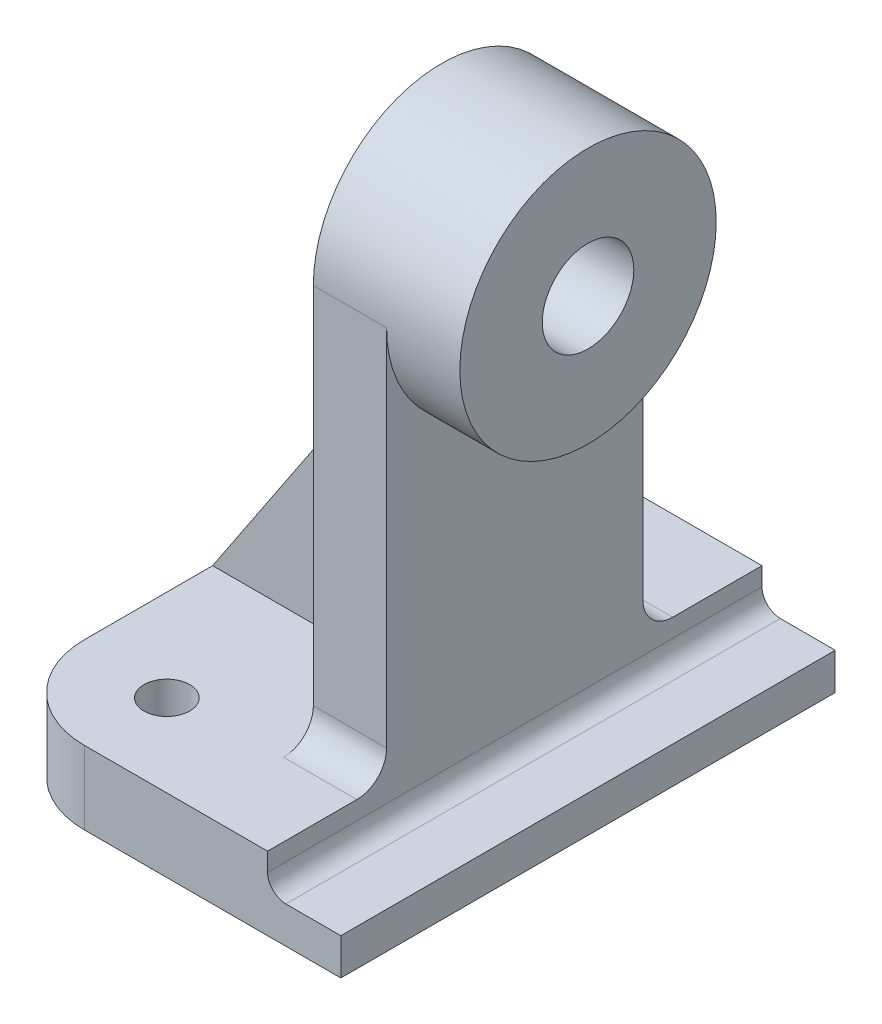
ISO-10303-21;
HEADER;
FILE_DESCRIPTION(('STEP AP214'),'2;1');
FILE_NAME('part.step','',(''),(''),'','','');
FILE_SCHEMA(('AUTOMOTIVE_DESIGN { 1 0 10303 214 1 1 1 1 }'));
ENDSEC;
DATA;
#1=APPLICATION_CONTEXT('core data for automotive mechanical design processes');
#2=APPLICATION_PROTOCOL_DEFINITION('international standard','automotive_design',2000,#1);
#3=PRODUCT_CONTEXT('',#1,'mechanical');
#4=PRODUCT('Part','Part','',(#3));
#5=PRODUCT_RELATED_PRODUCT_CATEGORY('part','',(#4));
#6=PRODUCT_DEFINITION_FORMATION('','',#4);
#7=PRODUCT_DEFINITION_CONTEXT('part definition',#1,'design');
#8=PRODUCT_DEFINITION('design','',#6,#7);
#9=PRODUCT_DEFINITION_SHAPE('','',#8);
#10=(LENGTH_UNIT() NAMED_UNIT(*) SI_UNIT(.MILLI.,.METRE.));
#11=(NAMED_UNIT(*) PLANE_ANGLE_UNIT() SI_UNIT($,.RADIAN.));
#12=(NAMED_UNIT(*) SI_UNIT($,.STERADIAN.) SOLID_ANGLE_UNIT());
#13=UNCERTAINTY_MEASURE_WITH_UNIT(LENGTH_MEASURE(1.E-05),#10,'distance_accuracy_value','');
#14=(GEOMETRIC_REPRESENTATION_CONTEXT(3) GLOBAL_UNCERTAINTY_ASSIGNED_CONTEXT((#13)) GLOBAL_UNIT_ASSIGNED_CONTEXT((#10,
#11,#12)) REPRESENTATION_CONTEXT('',''));
#15=CARTESIAN_POINT('',(0.,0.,0.));
#16=DIRECTION('',(0.,0.,1.));
#17=DIRECTION('',(1.,0.,0.));
#18=AXIS2_PLACEMENT_3D('',#15,#16,#17);
#19=CARTESIAN_POINT('',(-9.,8.,-17.));
#20=DIRECTION('',(0.,1.,0.));
#21=DIRECTION('',(0.,0.,1.));
#22=AXIS2_PLACEMENT_3D('',#19,#20,#21);
#23=PLANE('',#22);
#24=CARTESIAN_POINT('',(-9.00000000000002,8.,-18.));
#25=DIRECTION('',(0.,1.,0.));
#26=DIRECTION('',(0.,0.,-1.));
#27=AXIS2_PLACEMENT_3D('',#24,#25,#26);
#28=CIRCLE('',#27,2.5);
#29=CARTESIAN_POINT('',(-9.00000000000002,8.,-20.5));
#30=VERTEX_POINT('',#29);
#31=EDGE_CURVE('E295',#30,#30,#28,.T.);
#32=ORIENTED_EDGE('',*,*,#31,.F.);
#33=EDGE_LOOP('',(#32));
#34=FACE_BOUND('',#33,.T.);
#35=DIRECTION('',(0.,0.,1.));
#36=VECTOR('',#35,1.);
#37=CARTESIAN_POINT('',(-19.,8.,16.9999999999999));
#38=LINE('',#37,#36);
#39=CARTESIAN_POINT('',(-19.,8.,-16.9999999999999));
#40=VERTEX_POINT('',#39);
#41=CARTESIAN_POINT('',(-19.,8.,-3.));
#42=VERTEX_POINT('',#41);
#43=EDGE_CURVE('E184',#40,#42,#38,.T.);
#44=ORIENTED_EDGE('',*,*,#43,.T.);
#45=DIRECTION('',(1.,0.,0.));
#46=VECTOR('',#45,1.);
#47=CARTESIAN_POINT('',(-9.,8.,-3.));
#48=LINE('',#47,#46);
#49=CARTESIAN_POINT('',(3.,8.,-3.));
#50=VERTEX_POINT('',#49);
#51=EDGE_CURVE('E182',#42,#50,#48,.T.);
#52=ORIENTED_EDGE('',*,*,#51,.T.);
#53=DIRECTION('',(0.,0.,1.));
#54=VECTOR('',#53,1.);
#55=CARTESIAN_POINT('',(3.,8.,-20.5));
#56=LINE('',#55,#54);
#57=CARTESIAN_POINT('',(3.,7.99999999999995,-17.2499999999998));
#58=VERTEX_POINT('',#57);
#59=EDGE_CURVE('E166',#58,#50,#56,.T.);
#60=ORIENTED_EDGE('',*,*,#59,.F.);
#61=DIRECTION('',(-1.,0.,0.));
#62=VECTOR('',#61,1.);
#63=CARTESIAN_POINT('',(46.,7.99999999999995,-17.2499999999998));
#64=LINE('',#63,#62);
#65=CARTESIAN_POINT('',(11.,7.99999999999995,-17.2499999999998));
#66=VERTEX_POINT('',#65);
#67=EDGE_CURVE('E231',#66,#58,#64,.T.);
#68=ORIENTED_EDGE('',*,*,#67,.F.);
#69=DIRECTION('',(0.,0.,1.));
#70=VECTOR('',#69,1.);
#71=CARTESIAN_POINT('',(11.,8.,-27.));
#72=LINE('',#71,#70);
#73=CARTESIAN_POINT('',(11.,8.,-27.));
#74=VERTEX_POINT('',#73);
#75=EDGE_CURVE('E302',#74,#66,#72,.T.);
#76=ORIENTED_EDGE('',*,*,#75,.F.);
#77=DIRECTION('',(-1.,0.,0.));
#78=VECTOR('',#77,1.);
#79=CARTESIAN_POINT('',(-8.99999999999993,8.,-27.));
#80=LINE('',#79,#78);
#81=CARTESIAN_POINT('',(-8.99999999999993,8.,-27.));
#82=VERTEX_POINT('',#81);
#83=EDGE_CURVE('E335',#74,#82,#80,.T.);
#84=ORIENTED_EDGE('',*,*,#83,.T.);
#85=CARTESIAN_POINT('',(-9.,8.,-17.));
#86=DIRECTION('',(0.,1.,0.));
#87=DIRECTION('',(0.,0.,1.));
#88=AXIS2_PLACEMENT_3D('',#85,#86,#87);
#89=CIRCLE('',#88,10.);
#90=EDGE_CURVE('E321',#82,#40,#89,.T.);
#91=ORIENTED_EDGE('',*,*,#90,.T.);
#92=EDGE_LOOP('',(#44,#52,#60,#68,#76,#84,#91));
#93=FACE_BOUND('',#92,.T.);
#94=ADVANCED_FACE('F39',(#34,#93),#23,.T.);
#95=CARTESIAN_POINT('',(-9.,8.,-17.));
#96=DIRECTION('',(0.,-1.,0.));
#97=DIRECTION('',(0.,0.,-1.));
#98=AXIS2_PLACEMENT_3D('',#95,#96,#97);
#99=CYLINDRICAL_SURFACE('',#98,10.);
#100=CARTESIAN_POINT('',(-9.,0.,-17.));
#101=DIRECTION('',(0.,1.,0.));
#102=DIRECTION('',(0.,0.,1.));
#103=AXIS2_PLACEMENT_3D('',#100,#101,#102);
#104=CIRCLE('',#103,10.);
#105=CARTESIAN_POINT('',(-8.99999999999993,0.,-27.));
#106=VERTEX_POINT('',#105);
#107=CARTESIAN_POINT('',(-19.,0.,-16.9999999999999));
#108=VERTEX_POINT('',#107);
#109=EDGE_CURVE('E309',#106,#108,#104,.T.);
#110=ORIENTED_EDGE('',*,*,#109,.T.);
#111=DIRECTION('',(0.,-1.,0.));
#112=VECTOR('',#111,1.);
#113=CARTESIAN_POINT('',(-19.,8.,-16.9999999999999));
#114=LINE('',#113,#112);
#115=EDGE_CURVE('E375',#40,#108,#114,.T.);
#116=ORIENTED_EDGE('',*,*,#115,.F.);
#117=ORIENTED_EDGE('',*,*,#90,.F.);
#118=DIRECTION('',(0.,-1.,0.));
#119=VECTOR('',#118,1.);
#120=CARTESIAN_POINT('',(-8.99999999999993,8.,-27.));
#121=LINE('',#120,#119);
#122=EDGE_CURVE('E338',#82,#106,#121,.T.);
#123=ORIENTED_EDGE('',*,*,#122,.T.);
#124=EDGE_LOOP('',(#110,#116,#117,#123));
#125=FACE_BOUND('',#124,.T.);
#126=ADVANCED_FACE('F41',(#125),#99,.T.);
#127=CARTESIAN_POINT('',(-19.,8.,16.9999999999999));
#128=DIRECTION('',(1.,0.,0.));
#129=DIRECTION('',(0.,0.,-1.));
#130=AXIS2_PLACEMENT_3D('',#127,#128,#129);
#131=PLANE('',#130);
#132=CARTESIAN_POINT('',(-19.,8.,3.));
#133=VERTEX_POINT('',#132);
#134=CARTESIAN_POINT('',(-19.,8.,16.9999999999999));
#135=VERTEX_POINT('',#134);
#136=EDGE_CURVE('E324',#133,#135,#38,.T.);
#137=ORIENTED_EDGE('',*,*,#136,.F.);
#138=DIRECTION('',(0.,0.,-1.));
#139=VECTOR('',#138,1.);
#140=CARTESIAN_POINT('',(-19.,8.,-17.));
#141=LINE('',#140,#139);
#142=EDGE_CURVE('E62',#42,#133,#141,.F.);
#143=ORIENTED_EDGE('',*,*,#142,.F.);
#144=ORIENTED_EDGE('',*,*,#43,.F.);
#145=ORIENTED_EDGE('',*,*,#115,.T.);
#146=DIRECTION('',(0.,0.,1.));
#147=VECTOR('',#146,1.);
#148=CARTESIAN_POINT('',(-19.,0.,16.9999999999999));
#149=LINE('',#148,#147);
#150=CARTESIAN_POINT('',(-19.,0.,16.9999999999999));
#151=VERTEX_POINT('',#150);
#152=EDGE_CURVE('E342',#108,#151,#149,.T.);
#153=ORIENTED_EDGE('',*,*,#152,.T.);
#154=DIRECTION('',(0.,-1.,0.));
#155=VECTOR('',#154,1.);
#156=CARTESIAN_POINT('',(-19.,8.,16.9999999999999));
#157=LINE('',#156,#155);
#158=EDGE_CURVE('E371',#135,#151,#157,.T.);
#159=ORIENTED_EDGE('',*,*,#158,.F.);
#160=EDGE_LOOP('',(#137,#143,#144,#145,#153,#159));
#161=FACE_BOUND('',#160,.T.);
#162=ADVANCED_FACE('F408',(#161),#131,.F.);
#163=CARTESIAN_POINT('',(-9.,8.,17.));
#164=DIRECTION('',(0.,-1.,0.));
#165=DIRECTION('',(0.,0.,-1.));
#166=AXIS2_PLACEMENT_3D('',#163,#164,#165);
#167=CYLINDRICAL_SURFACE('',#166,10.);
#168=CARTESIAN_POINT('',(-9.,0.,17.));
#169=DIRECTION('',(0.,1.,0.));
#170=DIRECTION('',(0.,0.,-1.));
#171=AXIS2_PLACEMENT_3D('',#168,#169,#170);
#172=CIRCLE('',#171,10.);
#173=CARTESIAN_POINT('',(-8.99999999999993,0.,27.));
#174=VERTEX_POINT('',#173);
#175=EDGE_CURVE('E345',#151,#174,#172,.T.);
#176=ORIENTED_EDGE('',*,*,#175,.T.);
#177=DIRECTION('',(0.,-1.,0.));
#178=VECTOR('',#177,1.);
#179=CARTESIAN_POINT('',(-8.99999999999993,8.,27.));
#180=LINE('',#179,#178);
#181=CARTESIAN_POINT('',(-8.99999999999993,8.,27.));
#182=VERTEX_POINT('',#181);
#183=EDGE_CURVE('E367',#182,#174,#180,.T.);
#184=ORIENTED_EDGE('',*,*,#183,.F.);
#185=CARTESIAN_POINT('',(-9.,8.,17.));
#186=DIRECTION('',(0.,1.,0.));
#187=DIRECTION('',(0.,0.,-1.));
#188=AXIS2_PLACEMENT_3D('',#185,#186,#187);
#189=CIRCLE('',#188,10.);
#190=EDGE_CURVE('E328',#135,#182,#189,.T.);
#191=ORIENTED_EDGE('',*,*,#190,.F.);
#192=ORIENTED_EDGE('',*,*,#158,.T.);
#193=EDGE_LOOP('',(#176,#184,#191,#192));
#194=FACE_BOUND('',#193,.T.);
#195=ADVANCED_FACE('F414',(#194),#167,.T.);
#196=CARTESIAN_POINT('',(19.,8.,27.));
#197=DIRECTION('',(0.,0.,-1.));
#198=DIRECTION('',(-1.,0.,0.));
#199=AXIS2_PLACEMENT_3D('',#196,#197,#198);
#200=PLANE('',#199);
#201=DIRECTION('',(0.,-1.,0.));
#202=VECTOR('',#201,1.);
#203=CARTESIAN_POINT('',(19.,8.,27.));
#204=LINE('',#203,#202);
#205=CARTESIAN_POINT('',(19.,4.,27.));
#206=VERTEX_POINT('',#205);
#207=CARTESIAN_POINT('',(19.,0.,27.));
#208=VERTEX_POINT('',#207);
#209=EDGE_CURVE('E364',#206,#208,#204,.T.);
#210=ORIENTED_EDGE('',*,*,#209,.F.);
#211=DIRECTION('',(1.,0.,0.));
#212=VECTOR('',#211,1.);
#213=CARTESIAN_POINT('',(19.,4.,27.));
#214=LINE('',#213,#212);
#215=CARTESIAN_POINT('',(13.,4.,27.));
#216=VERTEX_POINT('',#215);
#217=EDGE_CURVE('E273',#216,#206,#214,.T.);
#218=ORIENTED_EDGE('',*,*,#217,.F.);
#219=CARTESIAN_POINT('',(13.,6.,27.));
#220=DIRECTION('',(0.,0.,1.));
#221=DIRECTION('',(1.,0.,0.));
#222=AXIS2_PLACEMENT_3D('',#219,#220,#221);
#223=CIRCLE('',#222,2.);
#224=CARTESIAN_POINT('',(11.,6.,27.));
#225=VERTEX_POINT('',#224);
#226=EDGE_CURVE('E285',#225,#216,#223,.T.);
#227=ORIENTED_EDGE('',*,*,#226,.F.);
#228=DIRECTION('',(0.,-1.,0.));
#229=VECTOR('',#228,1.);
#230=CARTESIAN_POINT('',(11.,6.,27.));
#231=LINE('',#230,#229);
#232=CARTESIAN_POINT('',(11.,8.,27.));
#233=VERTEX_POINT('',#232);
#234=EDGE_CURVE('E178',#233,#225,#231,.T.);
#235=ORIENTED_EDGE('',*,*,#234,.F.);
#236=DIRECTION('',(1.,0.,0.));
#237=VECTOR('',#236,1.);
#238=CARTESIAN_POINT('',(19.,8.,27.));
#239=LINE('',#238,#237);
#240=EDGE_CURVE('E331',#182,#233,#239,.T.);
#241=ORIENTED_EDGE('',*,*,#240,.F.);
#242=ORIENTED_EDGE('',*,*,#183,.T.);
#243=DIRECTION('',(1.,0.,0.));
#244=VECTOR('',#243,1.);
#245=CARTESIAN_POINT('',(19.,0.,27.));
#246=LINE('',#245,#244);
#247=EDGE_CURVE('E348',#174,#208,#246,.T.);
#248=ORIENTED_EDGE('',*,*,#247,.T.);
#249=EDGE_LOOP('',(#210,#218,#227,#235,#241,#242,#248));
#250=FACE_BOUND('',#249,.T.);
#251=ADVANCED_FACE('F422',(#250),#200,.F.);
#252=CARTESIAN_POINT('',(19.,8.,-27.));
#253=DIRECTION('',(-1.,0.,0.));
#254=DIRECTION('',(0.,0.,1.));
#255=AXIS2_PLACEMENT_3D('',#252,#253,#254);
#256=PLANE('',#255);
#257=DIRECTION('',(0.,0.,-1.));
#258=VECTOR('',#257,1.);
#259=CARTESIAN_POINT('',(19.,0.,-27.));
#260=LINE('',#259,#258);
#261=CARTESIAN_POINT('',(19.,0.,-27.));
#262=VERTEX_POINT('',#261);
#263=EDGE_CURVE('E352',#208,#262,#260,.T.);
#264=ORIENTED_EDGE('',*,*,#263,.T.);
#265=DIRECTION('',(0.,-1.,0.));
#266=VECTOR('',#265,1.);
#267=CARTESIAN_POINT('',(19.,8.,-27.));
#268=LINE('',#267,#266);
#269=CARTESIAN_POINT('',(19.,4.,-27.));
#270=VERTEX_POINT('',#269);
#271=EDGE_CURVE('E360',#270,#262,#268,.T.);
#272=ORIENTED_EDGE('',*,*,#271,.F.);
#273=DIRECTION('',(0.,0.,1.));
#274=VECTOR('',#273,1.);
#275=CARTESIAN_POINT('',(19.,4.,-27.));
#276=LINE('',#275,#274);
#277=EDGE_CURVE('E292',#270,#206,#276,.T.);
#278=ORIENTED_EDGE('',*,*,#277,.T.);
#279=ORIENTED_EDGE('',*,*,#209,.T.);
#280=EDGE_LOOP('',(#264,#272,#278,#279));
#281=FACE_BOUND('',#280,.T.);
#282=ADVANCED_FACE('F461',(#281),#256,.F.);
#283=CARTESIAN_POINT('',(-8.99999999999993,8.,-27.));
#284=DIRECTION('',(0.,0.,1.));
#285=DIRECTION('',(1.,0.,0.));
#286=AXIS2_PLACEMENT_3D('',#283,#284,#285);
#287=PLANE('',#286);
#288=CARTESIAN_POINT('',(13.,6.,-27.));
#289=DIRECTION('',(0.,0.,1.));
#290=DIRECTION('',(1.,0.,0.));
#291=AXIS2_PLACEMENT_3D('',#288,#289,#290);
#292=CIRCLE('',#291,2.);
#293=CARTESIAN_POINT('',(11.,6.,-27.));
#294=VERTEX_POINT('',#293);
#295=CARTESIAN_POINT('',(13.,4.,-27.));
#296=VERTEX_POINT('',#295);
#297=EDGE_CURVE('E272',#294,#296,#292,.T.);
#298=ORIENTED_EDGE('',*,*,#297,.T.);
#299=DIRECTION('',(1.,0.,0.));
#300=VECTOR('',#299,1.);
#301=CARTESIAN_POINT('',(19.,4.,-27.));
#302=LINE('',#301,#300);
#303=EDGE_CURVE('E277',#296,#270,#302,.T.);
#304=ORIENTED_EDGE('',*,*,#303,.T.);
#305=ORIENTED_EDGE('',*,*,#271,.T.);
#306=DIRECTION('',(-1.,0.,0.));
#307=VECTOR('',#306,1.);
#308=CARTESIAN_POINT('',(-8.99999999999993,0.,-27.));
#309=LINE('',#308,#307);
#310=EDGE_CURVE('E325',#262,#106,#309,.T.);
#311=ORIENTED_EDGE('',*,*,#310,.T.);
#312=ORIENTED_EDGE('',*,*,#122,.F.);
#313=ORIENTED_EDGE('',*,*,#83,.F.);
#314=DIRECTION('',(0.,-1.,0.));
#315=VECTOR('',#314,1.);
#316=CARTESIAN_POINT('',(11.,6.,-27.));
#317=LINE('',#316,#315);
#318=EDGE_CURVE('E268',#74,#294,#317,.T.);
#319=ORIENTED_EDGE('',*,*,#318,.T.);
#320=EDGE_LOOP('',(#298,#304,#305,#311,#312,#313,#319));
#321=FACE_BOUND('',#320,.T.);
#322=ADVANCED_FACE('F402',(#321),#287,.F.);
#323=DIRECTION('',(1.,0.,0.));
#324=VECTOR('',#323,1.);
#325=CARTESIAN_POINT('',(-9.,8.,3.));
#326=LINE('',#325,#324);
#327=CARTESIAN_POINT('',(3.,8.,2.99999999999999));
#328=VERTEX_POINT('',#327);
#329=EDGE_CURVE('E55',#133,#328,#326,.T.);
#330=ORIENTED_EDGE('',*,*,#329,.F.);
#331=ORIENTED_EDGE('',*,*,#136,.T.);
#332=ORIENTED_EDGE('',*,*,#190,.T.);
#333=ORIENTED_EDGE('',*,*,#240,.T.);
#334=CARTESIAN_POINT('',(11.,8.,17.25));
#335=VERTEX_POINT('',#334);
#336=EDGE_CURVE('E281',#335,#233,#72,.T.);
#337=ORIENTED_EDGE('',*,*,#336,.F.);
#338=DIRECTION('',(-1.,0.,0.));
#339=VECTOR('',#338,1.);
#340=CARTESIAN_POINT('',(46.,8.,17.25));
#341=LINE('',#340,#339);
#342=CARTESIAN_POINT('',(3.,8.,17.25));
#343=VERTEX_POINT('',#342);
#344=EDGE_CURVE('E236',#335,#343,#341,.T.);
#345=ORIENTED_EDGE('',*,*,#344,.T.);
#346=EDGE_CURVE('E179',#328,#343,#56,.T.);
#347=ORIENTED_EDGE('',*,*,#346,.F.);
#348=EDGE_LOOP('',(#330,#331,#332,#333,#337,#345,#347));
#349=FACE_BOUND('',#348,.T.);
#350=CARTESIAN_POINT('',(-9.,8.,18.));
#351=DIRECTION('',(0.,1.,0.));
#352=DIRECTION('',(0.,0.,1.));
#353=AXIS2_PLACEMENT_3D('',#350,#351,#352);
#354=CIRCLE('',#353,2.5);
#355=CARTESIAN_POINT('',(-9.,8.,20.5));
#356=VERTEX_POINT('',#355);
#357=EDGE_CURVE('E310',#356,#356,#354,.T.);
#358=ORIENTED_EDGE('',*,*,#357,.F.);
#359=EDGE_LOOP('',(#358));
#360=FACE_BOUND('',#359,.T.);
#361=ADVANCED_FACE('F427',(#349,#360),#23,.T.);
#362=CARTESIAN_POINT('',(-9.,0.,-17.));
#363=DIRECTION('',(0.,1.,0.));
#364=DIRECTION('',(0.,0.,1.));
#365=AXIS2_PLACEMENT_3D('',#362,#363,#364);
#366=PLANE('',#365);
#367=CARTESIAN_POINT('',(-9.,0.,18.));
#368=DIRECTION('',(0.,1.,0.));
#369=DIRECTION('',(0.,0.,1.));
#370=AXIS2_PLACEMENT_3D('',#367,#368,#369);
#371=CIRCLE('',#370,2.5);
#372=CARTESIAN_POINT('',(-9.,0.,20.5));
#373=VERTEX_POINT('',#372);
#374=EDGE_CURVE('E305',#373,#373,#371,.T.);
#375=ORIENTED_EDGE('',*,*,#374,.T.);
#376=EDGE_LOOP('',(#375));
#377=FACE_BOUND('',#376,.T.);
#378=ORIENTED_EDGE('',*,*,#175,.F.);
#379=ORIENTED_EDGE('',*,*,#152,.F.);
#380=ORIENTED_EDGE('',*,*,#109,.F.);
#381=ORIENTED_EDGE('',*,*,#310,.F.);
#382=ORIENTED_EDGE('',*,*,#263,.F.);
#383=ORIENTED_EDGE('',*,*,#247,.F.);
#384=EDGE_LOOP('',(#378,#379,#380,#381,#382,#383));
#385=FACE_BOUND('',#384,.T.);
#386=CARTESIAN_POINT('',(-9.00000000000002,0.,-18.));
#387=DIRECTION('',(0.,1.,0.));
#388=DIRECTION('',(0.,0.,-1.));
#389=AXIS2_PLACEMENT_3D('',#386,#387,#388);
#390=CIRCLE('',#389,2.5);
#391=CARTESIAN_POINT('',(-9.00000000000002,0.,-20.5));
#392=VERTEX_POINT('',#391);
#393=EDGE_CURVE('E314',#392,#392,#390,.T.);
#394=ORIENTED_EDGE('',*,*,#393,.T.);
#395=EDGE_LOOP('',(#394));
#396=FACE_BOUND('',#395,.T.);
#397=ADVANCED_FACE('F417',(#377,#385,#396),#366,.F.);
#398=CARTESIAN_POINT('',(-9.00000000000002,0.,-18.));
#399=DIRECTION('',(0.,1.,0.));
#400=DIRECTION('',(0.,0.,1.));
#401=AXIS2_PLACEMENT_3D('',#398,#399,#400);
#402=CYLINDRICAL_SURFACE('',#401,2.5);
#403=ORIENTED_EDGE('',*,*,#393,.F.);
#404=EDGE_LOOP('',(#403));
#405=FACE_BOUND('',#404,.T.);
#406=ORIENTED_EDGE('',*,*,#31,.T.);
#407=EDGE_LOOP('',(#406));
#408=FACE_BOUND('',#407,.T.);
#409=ADVANCED_FACE('F459',(#405,#408),#402,.F.);
#410=CARTESIAN_POINT('',(-9.,0.,18.));
#411=DIRECTION('',(0.,1.,0.));
#412=DIRECTION('',(0.,0.,1.));
#413=AXIS2_PLACEMENT_3D('',#410,#411,#412);
#414=CYLINDRICAL_SURFACE('',#413,2.5);
#415=ORIENTED_EDGE('',*,*,#374,.F.);
#416=EDGE_LOOP('',(#415));
#417=FACE_BOUND('',#416,.T.);
#418=ORIENTED_EDGE('',*,*,#357,.T.);
#419=EDGE_LOOP('',(#418));
#420=FACE_BOUND('',#419,.T.);
#421=ADVANCED_FACE('F518',(#417,#420),#414,.F.);
#422=CARTESIAN_POINT('',(19.,4.,-27.));
#423=DIRECTION('',(0.,-1.,0.));
#424=DIRECTION('',(1.,0.,0.));
#425=AXIS2_PLACEMENT_3D('',#422,#423,#424);
#426=PLANE('',#425);
#427=ORIENTED_EDGE('',*,*,#217,.T.);
#428=ORIENTED_EDGE('',*,*,#277,.F.);
#429=ORIENTED_EDGE('',*,*,#303,.F.);
#430=DIRECTION('',(0.,0.,1.));
#431=VECTOR('',#430,1.);
#432=CARTESIAN_POINT('',(13.,4.,-27.));
#433=LINE('',#432,#431);
#434=EDGE_CURVE('E296',#296,#216,#433,.T.);
#435=ORIENTED_EDGE('',*,*,#434,.T.);
#436=EDGE_LOOP('',(#427,#428,#429,#435));
#437=FACE_BOUND('',#436,.T.);
#438=ADVANCED_FACE('F512',(#437),#426,.F.);
#439=CARTESIAN_POINT('',(13.,6.,-27.));
#440=DIRECTION('',(0.,0.,1.));
#441=DIRECTION('',(1.,0.,0.));
#442=AXIS2_PLACEMENT_3D('',#439,#440,#441);
#443=CYLINDRICAL_SURFACE('',#442,2.);
#444=ORIENTED_EDGE('',*,*,#226,.T.);
#445=ORIENTED_EDGE('',*,*,#434,.F.);
#446=ORIENTED_EDGE('',*,*,#297,.F.);
#447=DIRECTION('',(0.,0.,1.));
#448=VECTOR('',#447,1.);
#449=CARTESIAN_POINT('',(11.,6.,-27.));
#450=LINE('',#449,#448);
#451=EDGE_CURVE('E299',#294,#225,#450,.T.);
#452=ORIENTED_EDGE('',*,*,#451,.T.);
#453=EDGE_LOOP('',(#444,#445,#446,#452));
#454=FACE_BOUND('',#453,.T.);
#455=ADVANCED_FACE('F517',(#454),#443,.F.);
#456=CARTESIAN_POINT('',(11.,6.,-27.));
#457=DIRECTION('',(-1.,0.,0.));
#458=DIRECTION('',(0.,0.,1.));
#459=AXIS2_PLACEMENT_3D('',#456,#457,#458);
#460=PLANE('',#459);
#461=ORIENTED_EDGE('',*,*,#234,.T.);
#462=ORIENTED_EDGE('',*,*,#451,.F.);
#463=ORIENTED_EDGE('',*,*,#318,.F.);
#464=ORIENTED_EDGE('',*,*,#75,.T.);
#465=CARTESIAN_POINT('',(11.,11.2499999999999,-17.2499999999998));
#466=DIRECTION('',(-1.,0.,0.));
#467=DIRECTION('',(0.,0.,1.));
#468=AXIS2_PLACEMENT_3D('',#465,#466,#467);
#469=CIRCLE('',#468,3.25);
#470=CARTESIAN_POINT('',(11.,11.25,-13.9999999999998));
#471=VERTEX_POINT('',#470);
#472=EDGE_CURVE('E260',#66,#471,#469,.T.);
#473=ORIENTED_EDGE('',*,*,#472,.T.);
#474=DIRECTION('',(0.,1.,0.));
#475=VECTOR('',#474,1.);
#476=CARTESIAN_POINT('',(11.,6.00000000000006,-13.9999999999998));
#477=LINE('',#476,#475);
#478=CARTESIAN_POINT('',(11.,50.9999999999999,-14.));
#479=VERTEX_POINT('',#478);
#480=EDGE_CURVE('E240',#471,#479,#477,.T.);
#481=ORIENTED_EDGE('',*,*,#480,.T.);
#482=CARTESIAN_POINT('',(11.,51.,0.));
#483=DIRECTION('',(-1.,0.,0.));
#484=DIRECTION('',(0.,0.,1.));
#485=AXIS2_PLACEMENT_3D('',#482,#483,#484);
#486=CIRCLE('',#485,14.);
#487=CARTESIAN_POINT('',(11.,51.,14.));
#488=VERTEX_POINT('',#487);
#489=EDGE_CURVE('E223',#479,#488,#486,.T.);
#490=ORIENTED_EDGE('',*,*,#489,.T.);
#491=DIRECTION('',(0.,-1.,0.));
#492=VECTOR('',#491,1.);
#493=CARTESIAN_POINT('',(11.,6.,14.));
#494=LINE('',#493,#492);
#495=CARTESIAN_POINT('',(11.,11.25,14.));
#496=VERTEX_POINT('',#495);
#497=EDGE_CURVE('E256',#488,#496,#494,.T.);
#498=ORIENTED_EDGE('',*,*,#497,.T.);
#499=CARTESIAN_POINT('',(11.,11.25,17.25));
#500=DIRECTION('',(-1.,0.,0.));
#501=DIRECTION('',(0.,0.,1.));
#502=AXIS2_PLACEMENT_3D('',#499,#500,#501);
#503=CIRCLE('',#502,3.25);
#504=EDGE_CURVE('E264',#496,#335,#503,.T.);
#505=ORIENTED_EDGE('',*,*,#504,.T.);
#506=ORIENTED_EDGE('',*,*,#336,.T.);
#507=EDGE_LOOP('',(#461,#462,#463,#464,#473,#481,#490,#498,#505,#506));
#508=FACE_BOUND('',#507,.T.);
#509=ADVANCED_FACE('F392',(#508),#460,.F.);
#510=CARTESIAN_POINT('',(3.,51.,-20.5));
#511=DIRECTION('',(1.,0.,0.));
#512=DIRECTION('',(0.,0.,-1.));
#513=AXIS2_PLACEMENT_3D('',#510,#511,#512);
#514=PLANE('',#513);
#515=CARTESIAN_POINT('',(3.,51.,0.));
#516=DIRECTION('',(1.,0.,0.));
#517=DIRECTION('',(0.,0.,-1.));
#518=AXIS2_PLACEMENT_3D('',#515,#516,#517);
#519=CIRCLE('',#518,5.);
#520=CARTESIAN_POINT('',(3.,51.,-5.00000000000002));
#521=VERTEX_POINT('',#520);
#522=EDGE_CURVE('E208',#521,#521,#519,.T.);
#523=ORIENTED_EDGE('',*,*,#522,.T.);
#524=EDGE_LOOP('',(#523));
#525=FACE_BOUND('',#524,.T.);
#526=DIRECTION('',(0.,0.,-1.));
#527=VECTOR('',#526,1.);
#528=CARTESIAN_POINT('',(3.,41.,-20.5));
#529=LINE('',#528,#527);
#530=CARTESIAN_POINT('',(3.,41.,-3.));
#531=VERTEX_POINT('',#530);
#532=CARTESIAN_POINT('',(3.,41.,3.));
#533=VERTEX_POINT('',#532);
#534=EDGE_CURVE('E202',#531,#533,#529,.F.);
#535=ORIENTED_EDGE('',*,*,#534,.T.);
#536=DIRECTION('',(0.,-1.,0.));
#537=VECTOR('',#536,1.);
#538=CARTESIAN_POINT('',(3.,51.,3.));
#539=LINE('',#538,#537);
#540=EDGE_CURVE('E196',#533,#328,#539,.T.);
#541=ORIENTED_EDGE('',*,*,#540,.T.);
#542=ORIENTED_EDGE('',*,*,#346,.T.);
#543=CARTESIAN_POINT('',(3.,11.25,17.25));
#544=DIRECTION('',(-1.,0.,0.));
#545=DIRECTION('',(0.,0.,1.));
#546=AXIS2_PLACEMENT_3D('',#543,#544,#545);
#547=CIRCLE('',#546,3.25);
#548=CARTESIAN_POINT('',(3.,11.25,14.));
#549=VERTEX_POINT('',#548);
#550=EDGE_CURVE('E230',#549,#343,#547,.T.);
#551=ORIENTED_EDGE('',*,*,#550,.F.);
#552=DIRECTION('',(0.,-1.,0.));
#553=VECTOR('',#552,1.);
#554=CARTESIAN_POINT('',(3.,11.25,14.));
#555=LINE('',#554,#553);
#556=CARTESIAN_POINT('',(3.,51.,14.));
#557=VERTEX_POINT('',#556);
#558=EDGE_CURVE('E226',#557,#549,#555,.T.);
#559=ORIENTED_EDGE('',*,*,#558,.F.);
#560=CARTESIAN_POINT('',(3.00000000000003,51.,0.));
#561=DIRECTION('',(1.,0.,0.));
#562=DIRECTION('',(0.,0.,-1.));
#563=AXIS2_PLACEMENT_3D('',#560,#561,#562);
#564=CIRCLE('',#563,14.);
#565=CARTESIAN_POINT('',(3.,51.,-13.9999999999998));
#566=VERTEX_POINT('',#565);
#567=EDGE_CURVE('E219',#566,#557,#564,.T.);
#568=ORIENTED_EDGE('',*,*,#567,.F.);
#569=DIRECTION('',(0.,1.,0.));
#570=VECTOR('',#569,1.);
#571=CARTESIAN_POINT('',(3.,11.25,-13.9999999999998));
#572=LINE('',#571,#570);
#573=CARTESIAN_POINT('',(3.,11.25,-13.9999999999998));
#574=VERTEX_POINT('',#573);
#575=EDGE_CURVE('E245',#574,#566,#572,.T.);
#576=ORIENTED_EDGE('',*,*,#575,.F.);
#577=CARTESIAN_POINT('',(3.,11.2499999999999,-17.2499999999998));
#578=DIRECTION('',(-1.,0.,0.));
#579=DIRECTION('',(0.,0.,-1.));
#580=AXIS2_PLACEMENT_3D('',#577,#578,#579);
#581=CIRCLE('',#580,3.25);
#582=EDGE_CURVE('E174',#58,#574,#581,.T.);
#583=ORIENTED_EDGE('',*,*,#582,.F.);
#584=ORIENTED_EDGE('',*,*,#59,.T.);
#585=DIRECTION('',(0.,-1.,0.));
#586=VECTOR('',#585,1.);
#587=CARTESIAN_POINT('',(3.,51.,-3.));
#588=LINE('',#587,#586);
#589=EDGE_CURVE('E170',#531,#50,#588,.T.);
#590=ORIENTED_EDGE('',*,*,#589,.F.);
#591=EDGE_LOOP('',(#535,#541,#542,#551,#559,#568,#576,#583,#584,#590));
#592=FACE_BOUND('',#591,.T.);
#593=ADVANCED_FACE('F168',(#525,#592),#514,.F.);
#594=CARTESIAN_POINT('',(46.,11.2499999999999,-17.2499999999998));
#595=DIRECTION('',(-1.,0.,0.));
#596=DIRECTION('',(0.,0.,1.));
#597=AXIS2_PLACEMENT_3D('',#594,#595,#596);
#598=CYLINDRICAL_SURFACE('',#597,3.25);
#599=ORIENTED_EDGE('',*,*,#67,.T.);
#600=ORIENTED_EDGE('',*,*,#582,.T.);
#601=DIRECTION('',(-1.,0.,0.));
#602=VECTOR('',#601,1.);
#603=CARTESIAN_POINT('',(46.,11.25,-13.9999999999998));
#604=LINE('',#603,#602);
#605=EDGE_CURVE('E248',#471,#574,#604,.T.);
#606=ORIENTED_EDGE('',*,*,#605,.F.);
#607=ORIENTED_EDGE('',*,*,#472,.F.);
#608=EDGE_LOOP('',(#599,#600,#606,#607));
#609=FACE_BOUND('',#608,.T.);
#610=ADVANCED_FACE('F397',(#609),#598,.F.);
#611=CARTESIAN_POINT('',(46.,11.25,-13.9999999999998));
#612=DIRECTION('',(0.,0.,1.));
#613=DIRECTION('',(0.,-1.,0.));
#614=AXIS2_PLACEMENT_3D('',#611,#612,#613);
#615=PLANE('',#614);
#616=ORIENTED_EDGE('',*,*,#605,.T.);
#617=ORIENTED_EDGE('',*,*,#575,.T.);
#618=DIRECTION('',(-1.,0.,0.));
#619=VECTOR('',#618,1.);
#620=CARTESIAN_POINT('',(0.,51.,-14.));
#621=LINE('',#620,#619);
#622=EDGE_CURVE('E48',#479,#566,#621,.T.);
#623=ORIENTED_EDGE('',*,*,#622,.F.);
#624=ORIENTED_EDGE('',*,*,#480,.F.);
#625=EDGE_LOOP('',(#616,#617,#623,#624));
#626=FACE_BOUND('',#625,.T.);
#627=ADVANCED_FACE('F395',(#626),#615,.F.);
#628=CARTESIAN_POINT('',(46.,11.25,17.25));
#629=DIRECTION('',(-1.,0.,0.));
#630=DIRECTION('',(0.,0.,1.));
#631=AXIS2_PLACEMENT_3D('',#628,#629,#630);
#632=CYLINDRICAL_SURFACE('',#631,3.25);
#633=DIRECTION('',(-1.,0.,0.));
#634=VECTOR('',#633,1.);
#635=CARTESIAN_POINT('',(46.,11.25,14.));
#636=LINE('',#635,#634);
#637=EDGE_CURVE('E235',#496,#549,#636,.T.);
#638=ORIENTED_EDGE('',*,*,#637,.T.);
#639=ORIENTED_EDGE('',*,*,#550,.T.);
#640=ORIENTED_EDGE('',*,*,#344,.F.);
#641=ORIENTED_EDGE('',*,*,#504,.F.);
#642=EDGE_LOOP('',(#638,#639,#640,#641));
#643=FACE_BOUND('',#642,.T.);
#644=ADVANCED_FACE('F435',(#643),#632,.F.);
#645=CARTESIAN_POINT('',(46.,11.25,14.));
#646=DIRECTION('',(0.,0.,-1.));
#647=DIRECTION('',(0.,1.,0.));
#648=AXIS2_PLACEMENT_3D('',#645,#646,#647);
#649=PLANE('',#648);
#650=DIRECTION('',(1.,0.,0.));
#651=VECTOR('',#650,1.);
#652=CARTESIAN_POINT('',(0.,51.,14.));
#653=LINE('',#652,#651);
#654=EDGE_CURVE('E11',#557,#488,#653,.T.);
#655=ORIENTED_EDGE('',*,*,#654,.F.);
#656=ORIENTED_EDGE('',*,*,#558,.T.);
#657=ORIENTED_EDGE('',*,*,#637,.F.);
#658=ORIENTED_EDGE('',*,*,#497,.F.);
#659=EDGE_LOOP('',(#655,#656,#657,#658));
#660=FACE_BOUND('',#659,.T.);
#661=ADVANCED_FACE('F389',(#660),#649,.F.);
#662=CARTESIAN_POINT('',(3.00000000000003,51.,0.));
#663=DIRECTION('',(1.,0.,0.));
#664=DIRECTION('',(0.,0.,-1.));
#665=AXIS2_PLACEMENT_3D('',#662,#663,#664);
#666=CYLINDRICAL_SURFACE('',#665,14.);
#667=CARTESIAN_POINT('',(19.,51.,0.));
#668=DIRECTION('',(1.,0.,0.));
#669=DIRECTION('',(0.,0.,-1.));
#670=AXIS2_PLACEMENT_3D('',#667,#668,#669);
#671=CIRCLE('',#670,14.);
#672=CARTESIAN_POINT('',(19.,51.,-14.));
#673=VERTEX_POINT('',#672);
#674=EDGE_CURVE('E212',#673,#673,#671,.T.);
#675=ORIENTED_EDGE('',*,*,#674,.F.);
#676=EDGE_LOOP('',(#675));
#677=FACE_BOUND('',#676,.T.);
#678=ORIENTED_EDGE('',*,*,#654,.T.);
#679=ORIENTED_EDGE('',*,*,#489,.F.);
#680=ORIENTED_EDGE('',*,*,#622,.T.);
#681=ORIENTED_EDGE('',*,*,#567,.T.);
#682=EDGE_LOOP('',(#678,#679,#680,#681));
#683=FACE_BOUND('',#682,.T.);
#684=ADVANCED_FACE('F383',(#677,#683),#666,.T.);
#685=CARTESIAN_POINT('',(19.,51.,0.));
#686=DIRECTION('',(1.,0.,0.));
#687=DIRECTION('',(0.,0.,-1.));
#688=AXIS2_PLACEMENT_3D('',#685,#686,#687);
#689=PLANE('',#688);
#690=CARTESIAN_POINT('',(19.,51.,0.));
#691=DIRECTION('',(1.,0.,0.));
#692=DIRECTION('',(0.,0.,-1.));
#693=AXIS2_PLACEMENT_3D('',#690,#691,#692);
#694=CIRCLE('',#693,5.);
#695=CARTESIAN_POINT('',(19.,51.,-5.00000000000002));
#696=VERTEX_POINT('',#695);
#697=EDGE_CURVE('E207',#696,#696,#694,.T.);
#698=ORIENTED_EDGE('',*,*,#697,.F.);
#699=EDGE_LOOP('',(#698));
#700=FACE_BOUND('',#699,.T.);
#701=ORIENTED_EDGE('',*,*,#674,.T.);
#702=EDGE_LOOP('',(#701));
#703=FACE_BOUND('',#702,.T.);
#704=ADVANCED_FACE('F560',(#700,#703),#689,.T.);
#705=CARTESIAN_POINT('',(3.,51.,0.));
#706=DIRECTION('',(1.,0.,0.));
#707=DIRECTION('',(0.,0.,-1.));
#708=AXIS2_PLACEMENT_3D('',#705,#706,#707);
#709=CYLINDRICAL_SURFACE('',#708,5.);
#710=ORIENTED_EDGE('',*,*,#697,.T.);
#711=EDGE_LOOP('',(#710));
#712=FACE_BOUND('',#711,.T.);
#713=ORIENTED_EDGE('',*,*,#522,.F.);
#714=EDGE_LOOP('',(#713));
#715=FACE_BOUND('',#714,.T.);
#716=ADVANCED_FACE('F569',(#712,#715),#709,.F.);
#717=CARTESIAN_POINT('',(-19.,8.,0.));
#718=DIRECTION('',(0.832050294337844,-0.554700196225229,0.));
#719=DIRECTION('',(0.554700196225229,0.832050294337844,0.));
#720=AXIS2_PLACEMENT_3D('',#717,#718,#719);
#721=PLANE('',#720);
#722=DIRECTION('',(0.554700196225229,0.832050294337844,0.));
#723=VECTOR('',#722,1.);
#724=CARTESIAN_POINT('',(-19.,8.,-3.));
#725=LINE('',#724,#723);
#726=EDGE_CURVE('E192',#42,#531,#725,.T.);
#727=ORIENTED_EDGE('',*,*,#726,.F.);
#728=ORIENTED_EDGE('',*,*,#142,.T.);
#729=DIRECTION('',(0.554700196225229,0.832050294337844,0.));
#730=VECTOR('',#729,1.);
#731=CARTESIAN_POINT('',(-19.,8.,3.));
#732=LINE('',#731,#730);
#733=EDGE_CURVE('E189',#133,#533,#732,.T.);
#734=ORIENTED_EDGE('',*,*,#733,.T.);
#735=ORIENTED_EDGE('',*,*,#534,.F.);
#736=EDGE_LOOP('',(#727,#728,#734,#735));
#737=FACE_BOUND('',#736,.T.);
#738=ADVANCED_FACE('F579',(#737),#721,.F.);
#739=CARTESIAN_POINT('',(0.,32.5,3.));
#740=DIRECTION('',(0.,0.,1.));
#741=DIRECTION('',(1.,0.,0.));
#742=AXIS2_PLACEMENT_3D('',#739,#740,#741);
#743=PLANE('',#742);
#744=ORIENTED_EDGE('',*,*,#540,.F.);
#745=ORIENTED_EDGE('',*,*,#733,.F.);
#746=ORIENTED_EDGE('',*,*,#329,.T.);
#747=EDGE_LOOP('',(#744,#745,#746));
#748=FACE_BOUND('',#747,.T.);
#749=ADVANCED_FACE('F590',(#748),#743,.T.);
#750=CARTESIAN_POINT('',(0.,32.5,-3.));
#751=DIRECTION('',(0.,0.,1.));
#752=DIRECTION('',(1.,0.,0.));
#753=AXIS2_PLACEMENT_3D('',#750,#751,#752);
#754=PLANE('',#753);
#755=ORIENTED_EDGE('',*,*,#726,.T.);
#756=ORIENTED_EDGE('',*,*,#589,.T.);
#757=ORIENTED_EDGE('',*,*,#51,.F.);
#758=EDGE_LOOP('',(#755,#756,#757));
#759=FACE_BOUND('',#758,.T.);
#760=ADVANCED_FACE('F191',(#759),#754,.F.);
#761=CLOSED_SHELL('',(#94,#126,#162,#195,#251,#282,#322,#361,#397,#409,#421,#438,#455,#509,#593,
#610,#627,#644,#661,#684,#704,#716,#738,#749,#760));
#762=MANIFOLD_SOLID_BREP('B2',#761);
#763=ADVANCED_BREP_SHAPE_REPRESENTATION('',(#18,#762),#14);
#764=SHAPE_DEFINITION_REPRESENTATION(#9,#763);
ENDSEC;
END-ISO-10303-21;
